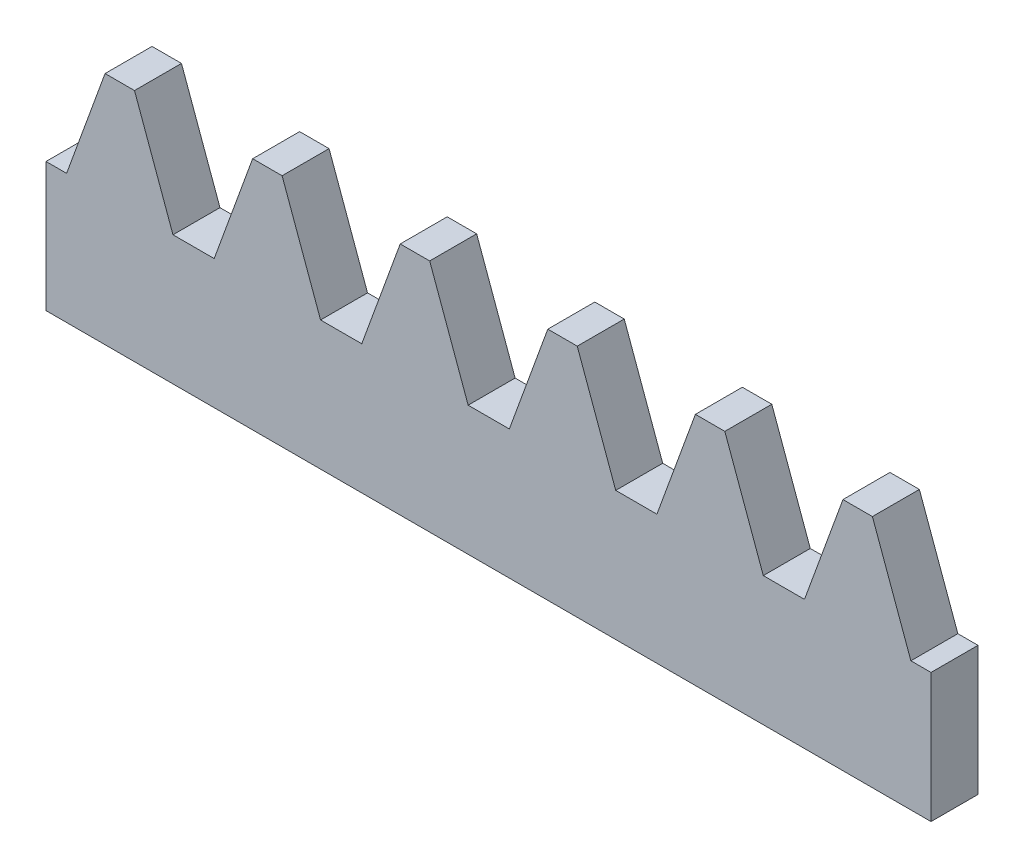
ISO-10303-21;
HEADER;
FILE_DESCRIPTION(('STEP AP214'),'2;1');
FILE_NAME('part.step','',(''),(''),'','','');
FILE_SCHEMA(('AUTOMOTIVE_DESIGN { 1 0 10303 214 1 1 1 1 }'));
ENDSEC;
DATA;
#1=APPLICATION_CONTEXT('core data for automotive mechanical design processes');
#2=APPLICATION_PROTOCOL_DEFINITION('international standard','automotive_design',2000,#1);
#3=PRODUCT_CONTEXT('',#1,'mechanical');
#4=PRODUCT('Part','Part','',(#3));
#5=PRODUCT_RELATED_PRODUCT_CATEGORY('part','',(#4));
#6=PRODUCT_DEFINITION_FORMATION('','',#4);
#7=PRODUCT_DEFINITION_CONTEXT('part definition',#1,'design');
#8=PRODUCT_DEFINITION('design','',#6,#7);
#9=PRODUCT_DEFINITION_SHAPE('','',#8);
#10=(LENGTH_UNIT() NAMED_UNIT(*) SI_UNIT(.MILLI.,.METRE.));
#11=(NAMED_UNIT(*) PLANE_ANGLE_UNIT() SI_UNIT($,.RADIAN.));
#12=(NAMED_UNIT(*) SI_UNIT($,.STERADIAN.) SOLID_ANGLE_UNIT());
#13=UNCERTAINTY_MEASURE_WITH_UNIT(LENGTH_MEASURE(1.E-05),#10,'distance_accuracy_value','');
#14=(GEOMETRIC_REPRESENTATION_CONTEXT(3) GLOBAL_UNCERTAINTY_ASSIGNED_CONTEXT((#13)) GLOBAL_UNIT_ASSIGNED_CONTEXT((#10,
#11,#12)) REPRESENTATION_CONTEXT('',''));
#15=CARTESIAN_POINT('',(0.,0.,0.));
#16=DIRECTION('',(0.,0.,1.));
#17=DIRECTION('',(1.,0.,0.));
#18=AXIS2_PLACEMENT_3D('',#15,#16,#17);
#19=CARTESIAN_POINT('',(0.,32.7476290034239,21.3342048450141));
#20=DIRECTION('',(0.,1.,0.));
#21=DIRECTION('',(0.,0.,1.));
#22=AXIS2_PLACEMENT_3D('',#19,#20,#21);
#23=PLANE('',#22);
#24=DIRECTION('',(0.,0.,1.));
#25=VECTOR('',#24,1.);
#26=CARTESIAN_POINT('',(91.7612773180347,32.7476290034239,21.3342048450141));
#27=LINE('',#26,#25);
#28=CARTESIAN_POINT('',(91.7612773180347,32.7476290034239,21.3342048450141));
#29=VERTEX_POINT('',#28);
#30=CARTESIAN_POINT('',(91.7612773180347,32.7476290034239,27.6842048450141));
#31=VERTEX_POINT('',#30);
#32=EDGE_CURVE('E266',#29,#31,#27,.T.);
#33=ORIENTED_EDGE('',*,*,#32,.F.);
#34=DIRECTION('',(-1.,0.,0.));
#35=VECTOR('',#34,1.);
#36=CARTESIAN_POINT('',(0.,32.7476290034239,21.3342048450141));
#37=LINE('',#36,#35);
#38=CARTESIAN_POINT('',(87.7807426294653,32.7476290034239,21.3342048450141));
#39=VERTEX_POINT('',#38);
#40=EDGE_CURVE('E393',#29,#39,#37,.T.);
#41=ORIENTED_EDGE('',*,*,#40,.T.);
#42=DIRECTION('',(0.,0.,-1.));
#43=VECTOR('',#42,1.);
#44=CARTESIAN_POINT('',(87.7807426294653,32.7476290034239,21.3342048450141));
#45=LINE('',#44,#43);
#46=CARTESIAN_POINT('',(87.7807426294653,32.7476290034239,27.6842048450141));
#47=VERTEX_POINT('',#46);
#48=EDGE_CURVE('E286',#47,#39,#45,.T.);
#49=ORIENTED_EDGE('',*,*,#48,.F.);
#50=DIRECTION('',(-1.,0.,0.));
#51=VECTOR('',#50,1.);
#52=CARTESIAN_POINT('',(0.,32.7476290034239,27.6842048450141));
#53=LINE('',#52,#51);
#54=EDGE_CURVE('E403',#31,#47,#53,.T.);
#55=ORIENTED_EDGE('',*,*,#54,.F.);
#56=EDGE_LOOP('',(#33,#41,#49,#55));
#57=FACE_BOUND('',#56,.T.);
#58=ADVANCED_FACE('F37',(#57),#23,.T.);
#59=DIRECTION('',(0.,0.,1.));
#60=VECTOR('',#59,1.);
#61=CARTESIAN_POINT('',(71.8121639905347,32.7476290034239,21.3342048450141));
#62=LINE('',#61,#60);
#63=CARTESIAN_POINT('',(71.8121639905347,32.7476290034239,21.3342048450141));
#64=VERTEX_POINT('',#63);
#65=CARTESIAN_POINT('',(71.8121639905347,32.7476290034239,27.6842048450141));
#66=VERTEX_POINT('',#65);
#67=EDGE_CURVE('E290',#64,#66,#62,.T.);
#68=ORIENTED_EDGE('',*,*,#67,.F.);
#69=CARTESIAN_POINT('',(67.8316293019653,32.7476290034239,21.3342048450141));
#70=VERTEX_POINT('',#69);
#71=EDGE_CURVE('E461',#64,#70,#37,.T.);
#72=ORIENTED_EDGE('',*,*,#71,.T.);
#73=DIRECTION('',(0.,0.,-1.));
#74=VECTOR('',#73,1.);
#75=CARTESIAN_POINT('',(67.8316293019653,32.7476290034239,21.3342048450141));
#76=LINE('',#75,#74);
#77=CARTESIAN_POINT('',(67.8316293019653,32.7476290034239,27.6842048450141));
#78=VERTEX_POINT('',#77);
#79=EDGE_CURVE('E310',#78,#70,#76,.T.);
#80=ORIENTED_EDGE('',*,*,#79,.F.);
#81=EDGE_CURVE('E434',#66,#78,#53,.T.);
#82=ORIENTED_EDGE('',*,*,#81,.F.);
#83=EDGE_LOOP('',(#68,#72,#80,#82));
#84=FACE_BOUND('',#83,.T.);
#85=ADVANCED_FACE('F479',(#84),#23,.T.);
#86=DIRECTION('',(0.,0.,1.));
#87=VECTOR('',#86,1.);
#88=CARTESIAN_POINT('',(51.8630506630347,32.7476290034239,21.3342048450141));
#89=LINE('',#88,#87);
#90=CARTESIAN_POINT('',(51.8630506630347,32.7476290034239,21.3342048450141));
#91=VERTEX_POINT('',#90);
#92=CARTESIAN_POINT('',(51.8630506630347,32.7476290034239,27.6842048450141));
#93=VERTEX_POINT('',#92);
#94=EDGE_CURVE('E314',#91,#93,#89,.T.);
#95=ORIENTED_EDGE('',*,*,#94,.F.);
#96=CARTESIAN_POINT('',(47.8825159744653,32.7476290034239,21.3342048450141));
#97=VERTEX_POINT('',#96);
#98=EDGE_CURVE('E456',#91,#97,#37,.T.);
#99=ORIENTED_EDGE('',*,*,#98,.T.);
#100=DIRECTION('',(0.,0.,-1.));
#101=VECTOR('',#100,1.);
#102=CARTESIAN_POINT('',(47.8825159744653,32.7476290034239,21.3342048450141));
#103=LINE('',#102,#101);
#104=CARTESIAN_POINT('',(47.8825159744653,32.7476290034239,27.6842048450141));
#105=VERTEX_POINT('',#104);
#106=EDGE_CURVE('E334',#105,#97,#103,.T.);
#107=ORIENTED_EDGE('',*,*,#106,.F.);
#108=EDGE_CURVE('E435',#93,#105,#53,.T.);
#109=ORIENTED_EDGE('',*,*,#108,.F.);
#110=EDGE_LOOP('',(#95,#99,#107,#109));
#111=FACE_BOUND('',#110,.T.);
#112=ADVANCED_FACE('F489',(#111),#23,.T.);
#113=DIRECTION('',(0.,0.,1.));
#114=VECTOR('',#113,1.);
#115=CARTESIAN_POINT('',(31.9139373355347,32.7476290034239,21.3342048450141));
#116=LINE('',#115,#114);
#117=CARTESIAN_POINT('',(31.9139373355347,32.7476290034239,21.3342048450141));
#118=VERTEX_POINT('',#117);
#119=CARTESIAN_POINT('',(31.9139373355347,32.7476290034239,27.6842048450141));
#120=VERTEX_POINT('',#119);
#121=EDGE_CURVE('E338',#118,#120,#116,.T.);
#122=ORIENTED_EDGE('',*,*,#121,.F.);
#123=CARTESIAN_POINT('',(27.9334026469653,32.7476290034239,21.3342048450141));
#124=VERTEX_POINT('',#123);
#125=EDGE_CURVE('E455',#118,#124,#37,.T.);
#126=ORIENTED_EDGE('',*,*,#125,.T.);
#127=DIRECTION('',(0.,0.,-1.));
#128=VECTOR('',#127,1.);
#129=CARTESIAN_POINT('',(27.9334026469653,32.7476290034239,21.3342048450141));
#130=LINE('',#129,#128);
#131=CARTESIAN_POINT('',(27.9334026469653,32.7476290034239,27.6842048450141));
#132=VERTEX_POINT('',#131);
#133=EDGE_CURVE('E358',#132,#124,#130,.T.);
#134=ORIENTED_EDGE('',*,*,#133,.F.);
#135=EDGE_CURVE('E438',#120,#132,#53,.T.);
#136=ORIENTED_EDGE('',*,*,#135,.F.);
#137=EDGE_LOOP('',(#122,#126,#134,#136));
#138=FACE_BOUND('',#137,.T.);
#139=ADVANCED_FACE('F499',(#138),#23,.T.);
#140=DIRECTION('',(0.,0.,1.));
#141=VECTOR('',#140,1.);
#142=CARTESIAN_POINT('',(11.9648240080347,32.7476290034239,21.3342048450141));
#143=LINE('',#142,#141);
#144=CARTESIAN_POINT('',(11.9648240080347,32.7476290034239,21.3342048450141));
#145=VERTEX_POINT('',#144);
#146=CARTESIAN_POINT('',(11.9648240080347,32.7476290034239,27.6842048450141));
#147=VERTEX_POINT('',#146);
#148=EDGE_CURVE('E362',#145,#147,#143,.T.);
#149=ORIENTED_EDGE('',*,*,#148,.F.);
#150=CARTESIAN_POINT('',(7.98428931946533,32.7476290034239,21.3342048450141));
#151=VERTEX_POINT('',#150);
#152=EDGE_CURVE('E390',#145,#151,#37,.T.);
#153=ORIENTED_EDGE('',*,*,#152,.T.);
#154=DIRECTION('',(0.,0.,-1.));
#155=VECTOR('',#154,1.);
#156=CARTESIAN_POINT('',(7.98428931946533,32.7476290034239,21.3342048450141));
#157=LINE('',#156,#155);
#158=CARTESIAN_POINT('',(7.98428931946533,32.7476290034239,27.6842048450141));
#159=VERTEX_POINT('',#158);
#160=EDGE_CURVE('E378',#159,#151,#157,.T.);
#161=ORIENTED_EDGE('',*,*,#160,.F.);
#162=EDGE_CURVE('E401',#147,#159,#53,.T.);
#163=ORIENTED_EDGE('',*,*,#162,.F.);
#164=EDGE_LOOP('',(#149,#153,#161,#163));
#165=FACE_BOUND('',#164,.T.);
#166=ADVANCED_FACE('F453',(#165),#23,.T.);
#167=CARTESIAN_POINT('',(0.,0.997629003423928,21.3342048450141));
#168=DIRECTION('',(-1.,0.,0.));
#169=DIRECTION('',(0.,0.,1.));
#170=AXIS2_PLACEMENT_3D('',#167,#168,#169);
#171=PLANE('',#170);
#172=DIRECTION('',(0.,0.,1.));
#173=VECTOR('',#172,1.);
#174=CARTESIAN_POINT('',(0.,18.4601290034239,21.3342048450141));
#175=LINE('',#174,#173);
#176=CARTESIAN_POINT('',(0.,18.4601290034239,21.3342048450141));
#177=VERTEX_POINT('',#176);
#178=CARTESIAN_POINT('',(0.,18.4601290034239,27.6842048450141));
#179=VERTEX_POINT('',#178);
#180=EDGE_CURVE('E376',#177,#179,#175,.T.);
#181=ORIENTED_EDGE('',*,*,#180,.F.);
#182=DIRECTION('',(0.,-1.,0.));
#183=VECTOR('',#182,1.);
#184=CARTESIAN_POINT('',(0.,0.997629003423928,21.3342048450141));
#185=LINE('',#184,#183);
#186=CARTESIAN_POINT('',(0.,0.997629003423928,21.3342048450141));
#187=VERTEX_POINT('',#186);
#188=EDGE_CURVE('E382',#177,#187,#185,.T.);
#189=ORIENTED_EDGE('',*,*,#188,.T.);
#190=DIRECTION('',(0.,0.,1.));
#191=VECTOR('',#190,1.);
#192=CARTESIAN_POINT('',(0.,0.997629003423928,21.3342048450141));
#193=LINE('',#192,#191);
#194=CARTESIAN_POINT('',(0.,0.997629003423928,27.6842048450141));
#195=VERTEX_POINT('',#194);
#196=EDGE_CURVE('E392',#187,#195,#193,.T.);
#197=ORIENTED_EDGE('',*,*,#196,.T.);
#198=DIRECTION('',(0.,-1.,0.));
#199=VECTOR('',#198,1.);
#200=CARTESIAN_POINT('',(0.,0.997629003423928,27.6842048450141));
#201=LINE('',#200,#199);
#202=EDGE_CURVE('E381',#179,#195,#201,.T.);
#203=ORIENTED_EDGE('',*,*,#202,.F.);
#204=EDGE_LOOP('',(#181,#189,#197,#203));
#205=FACE_BOUND('',#204,.T.);
#206=ADVANCED_FACE('F39',(#205),#171,.T.);
#207=DIRECTION('',(0.,0.,1.));
#208=VECTOR('',#207,1.);
#209=CARTESIAN_POINT('',(111.710390645535,32.7476290034239,21.3342048450141));
#210=LINE('',#209,#208);
#211=CARTESIAN_POINT('',(111.710390645535,32.7476290034239,21.3342048450141));
#212=VERTEX_POINT('',#211);
#213=CARTESIAN_POINT('',(111.710390645535,32.7476290034239,27.6842048450141));
#214=VERTEX_POINT('',#213);
#215=EDGE_CURVE('E245',#212,#214,#210,.T.);
#216=ORIENTED_EDGE('',*,*,#215,.F.);
#217=CARTESIAN_POINT('',(107.729855956965,32.7476290034239,21.3342048450141));
#218=VERTEX_POINT('',#217);
#219=EDGE_CURVE('E239',#212,#218,#37,.T.);
#220=ORIENTED_EDGE('',*,*,#219,.T.);
#221=DIRECTION('',(0.,0.,-1.));
#222=VECTOR('',#221,1.);
#223=CARTESIAN_POINT('',(107.729855956965,32.7476290034239,21.3342048450141));
#224=LINE('',#223,#222);
#225=CARTESIAN_POINT('',(107.729855956965,32.7476290034239,27.6842048450141));
#226=VERTEX_POINT('',#225);
#227=EDGE_CURVE('E262',#226,#218,#224,.T.);
#228=ORIENTED_EDGE('',*,*,#227,.F.);
#229=EDGE_CURVE('E385',#214,#226,#53,.T.);
#230=ORIENTED_EDGE('',*,*,#229,.F.);
#231=EDGE_LOOP('',(#216,#220,#228,#230));
#232=FACE_BOUND('',#231,.T.);
#233=ADVANCED_FACE('F522',(#232),#23,.T.);
#234=CARTESIAN_POINT('',(119.634,0.997629003423928,21.3342048450141));
#235=DIRECTION('',(1.,0.,0.));
#236=DIRECTION('',(0.,0.,-1.));
#237=AXIS2_PLACEMENT_3D('',#234,#235,#236);
#238=PLANE('',#237);
#239=DIRECTION('',(0.,0.,-1.));
#240=VECTOR('',#239,1.);
#241=CARTESIAN_POINT('',(119.634,18.4601290034239,21.3342048450141));
#242=LINE('',#241,#240);
#243=CARTESIAN_POINT('',(119.634,18.4601290034239,27.6842048450141));
#244=VERTEX_POINT('',#243);
#245=CARTESIAN_POINT('',(119.634,18.4601290034239,21.3342048450141));
#246=VERTEX_POINT('',#245);
#247=EDGE_CURVE('E226',#244,#246,#242,.T.);
#248=ORIENTED_EDGE('',*,*,#247,.F.);
#249=DIRECTION('',(0.,1.,0.));
#250=VECTOR('',#249,1.);
#251=CARTESIAN_POINT('',(119.634,0.997629003423928,27.6842048450141));
#252=LINE('',#251,#250);
#253=CARTESIAN_POINT('',(119.634,0.997629003423928,27.6842048450141));
#254=VERTEX_POINT('',#253);
#255=EDGE_CURVE('E398',#254,#244,#252,.T.);
#256=ORIENTED_EDGE('',*,*,#255,.F.);
#257=DIRECTION('',(0.,0.,1.));
#258=VECTOR('',#257,1.);
#259=CARTESIAN_POINT('',(119.634,0.997629003423928,21.3342048450141));
#260=LINE('',#259,#258);
#261=CARTESIAN_POINT('',(119.634,0.997629003423928,21.3342048450141));
#262=VERTEX_POINT('',#261);
#263=EDGE_CURVE('E404',#262,#254,#260,.T.);
#264=ORIENTED_EDGE('',*,*,#263,.F.);
#265=DIRECTION('',(0.,1.,0.));
#266=VECTOR('',#265,1.);
#267=CARTESIAN_POINT('',(119.634,0.997629003423928,21.3342048450141));
#268=LINE('',#267,#266);
#269=EDGE_CURVE('E388',#262,#246,#268,.T.);
#270=ORIENTED_EDGE('',*,*,#269,.T.);
#271=EDGE_LOOP('',(#248,#256,#264,#270));
#272=FACE_BOUND('',#271,.T.);
#273=ADVANCED_FACE('F529',(#272),#238,.T.);
#274=CARTESIAN_POINT('',(0.,0.997629003423928,21.3342048450141));
#275=DIRECTION('',(0.,-1.,0.));
#276=DIRECTION('',(0.,0.,-1.));
#277=AXIS2_PLACEMENT_3D('',#274,#275,#276);
#278=PLANE('',#277);
#279=DIRECTION('',(1.,0.,0.));
#280=VECTOR('',#279,1.);
#281=CARTESIAN_POINT('',(0.,0.997629003423928,27.6842048450141));
#282=LINE('',#281,#280);
#283=EDGE_CURVE('E395',#195,#254,#282,.T.);
#284=ORIENTED_EDGE('',*,*,#283,.F.);
#285=ORIENTED_EDGE('',*,*,#196,.F.);
#286=DIRECTION('',(1.,0.,0.));
#287=VECTOR('',#286,1.);
#288=CARTESIAN_POINT('',(0.,0.997629003423928,21.3342048450141));
#289=LINE('',#288,#287);
#290=EDGE_CURVE('E384',#187,#262,#289,.T.);
#291=ORIENTED_EDGE('',*,*,#290,.T.);
#292=ORIENTED_EDGE('',*,*,#263,.T.);
#293=EDGE_LOOP('',(#284,#285,#291,#292));
#294=FACE_BOUND('',#293,.T.);
#295=ADVANCED_FACE('F535',(#294),#278,.T.);
#296=CARTESIAN_POINT('',(0.,32.7476290034239,21.3342048450141));
#297=DIRECTION('',(0.,0.,-1.));
#298=DIRECTION('',(-1.,0.,0.));
#299=AXIS2_PLACEMENT_3D('',#296,#297,#298);
#300=PLANE('',#299);
#301=DIRECTION('',(0.342020143325663,-0.939692620785911,0.));
#302=VECTOR('',#301,1.);
#303=CARTESIAN_POINT('',(111.701145801584,32.7730290034239,21.3342048450141));
#304=LINE('',#303,#302);
#305=CARTESIAN_POINT('',(116.910615367613,18.4601290034239,21.3342048450141));
#306=VERTEX_POINT('',#305);
#307=EDGE_CURVE('E223',#212,#306,#304,.T.);
#308=ORIENTED_EDGE('',*,*,#307,.T.);
#309=DIRECTION('',(1.,0.,0.));
#310=VECTOR('',#309,1.);
#311=CARTESIAN_POINT('',(122.478744562387,18.4601290034239,21.3342048450141));
#312=LINE('',#311,#310);
#313=EDGE_CURVE('E227',#306,#246,#312,.T.);
#314=ORIENTED_EDGE('',*,*,#313,.T.);
#315=ORIENTED_EDGE('',*,*,#269,.F.);
#316=ORIENTED_EDGE('',*,*,#290,.F.);
#317=ORIENTED_EDGE('',*,*,#188,.F.);
#318=DIRECTION('',(1.,0.,0.));
#319=VECTOR('',#318,1.);
#320=CARTESIAN_POINT('',(2.78406459738706,18.4601290034239,21.3342048450141));
#321=LINE('',#320,#319);
#322=CARTESIAN_POINT('',(2.78406459738706,18.4601290034239,21.3342048450141));
#323=VERTEX_POINT('',#322);
#324=EDGE_CURVE('E365',#177,#323,#321,.T.);
#325=ORIENTED_EDGE('',*,*,#324,.T.);
#326=DIRECTION('',(0.342020143325663,0.939692620785911,0.));
#327=VECTOR('',#326,1.);
#328=CARTESIAN_POINT('',(7.99353416341569,32.7730290034239,21.3342048450141));
#329=LINE('',#328,#327);
#330=EDGE_CURVE('E368',#323,#151,#329,.T.);
#331=ORIENTED_EDGE('',*,*,#330,.T.);
#332=ORIENTED_EDGE('',*,*,#152,.F.);
#333=DIRECTION('',(0.342020143325663,-0.939692620785911,0.));
#334=VECTOR('',#333,1.);
#335=CARTESIAN_POINT('',(11.9555791640843,32.7730290034239,21.3342048450141));
#336=LINE('',#335,#334);
#337=CARTESIAN_POINT('',(17.1650487301129,18.4601290034239,21.3342048450141));
#338=VERTEX_POINT('',#337);
#339=EDGE_CURVE('E341',#145,#338,#336,.T.);
#340=ORIENTED_EDGE('',*,*,#339,.T.);
#341=DIRECTION('',(1.,0.,0.));
#342=VECTOR('',#341,1.);
#343=CARTESIAN_POINT('',(22.7331779248871,18.4601290034239,21.3342048450141));
#344=LINE('',#343,#342);
#345=CARTESIAN_POINT('',(22.7331779248871,18.4601290034239,21.3342048450141));
#346=VERTEX_POINT('',#345);
#347=EDGE_CURVE('E344',#338,#346,#344,.T.);
#348=ORIENTED_EDGE('',*,*,#347,.T.);
#349=DIRECTION('',(0.342020143325663,0.939692620785911,0.));
#350=VECTOR('',#349,1.);
#351=CARTESIAN_POINT('',(27.9426474909157,32.7730290034239,21.3342048450141));
#352=LINE('',#351,#350);
#353=EDGE_CURVE('E348',#346,#124,#352,.T.);
#354=ORIENTED_EDGE('',*,*,#353,.T.);
#355=ORIENTED_EDGE('',*,*,#125,.F.);
#356=DIRECTION('',(0.342020143325663,-0.939692620785911,0.));
#357=VECTOR('',#356,1.);
#358=CARTESIAN_POINT('',(31.9046924915843,32.7730290034239,21.3342048450141));
#359=LINE('',#358,#357);
#360=CARTESIAN_POINT('',(37.1141620576129,18.4601290034239,21.3342048450141));
#361=VERTEX_POINT('',#360);
#362=EDGE_CURVE('E317',#118,#361,#359,.T.);
#363=ORIENTED_EDGE('',*,*,#362,.T.);
#364=DIRECTION('',(1.,0.,0.));
#365=VECTOR('',#364,1.);
#366=CARTESIAN_POINT('',(42.6822912523871,18.4601290034239,21.3342048450141));
#367=LINE('',#366,#365);
#368=CARTESIAN_POINT('',(42.6822912523871,18.4601290034239,21.3342048450141));
#369=VERTEX_POINT('',#368);
#370=EDGE_CURVE('E320',#361,#369,#367,.T.);
#371=ORIENTED_EDGE('',*,*,#370,.T.);
#372=DIRECTION('',(0.342020143325663,0.939692620785911,0.));
#373=VECTOR('',#372,1.);
#374=CARTESIAN_POINT('',(47.8917608184157,32.7730290034239,21.3342048450141));
#375=LINE('',#374,#373);
#376=EDGE_CURVE('E324',#369,#97,#375,.T.);
#377=ORIENTED_EDGE('',*,*,#376,.T.);
#378=ORIENTED_EDGE('',*,*,#98,.F.);
#379=DIRECTION('',(0.342020143325663,-0.939692620785911,0.));
#380=VECTOR('',#379,1.);
#381=CARTESIAN_POINT('',(51.8538058190843,32.7730290034239,21.3342048450141));
#382=LINE('',#381,#380);
#383=CARTESIAN_POINT('',(57.0632753851129,18.4601290034239,21.3342048450141));
#384=VERTEX_POINT('',#383);
#385=EDGE_CURVE('E293',#91,#384,#382,.T.);
#386=ORIENTED_EDGE('',*,*,#385,.T.);
#387=DIRECTION('',(1.,0.,0.));
#388=VECTOR('',#387,1.);
#389=CARTESIAN_POINT('',(62.6314045798871,18.4601290034239,21.3342048450141));
#390=LINE('',#389,#388);
#391=CARTESIAN_POINT('',(62.6314045798871,18.4601290034239,21.3342048450141));
#392=VERTEX_POINT('',#391);
#393=EDGE_CURVE('E296',#384,#392,#390,.T.);
#394=ORIENTED_EDGE('',*,*,#393,.T.);
#395=DIRECTION('',(0.342020143325663,0.939692620785911,0.));
#396=VECTOR('',#395,1.);
#397=CARTESIAN_POINT('',(67.8408741459157,32.7730290034239,21.3342048450141));
#398=LINE('',#397,#396);
#399=EDGE_CURVE('E300',#392,#70,#398,.T.);
#400=ORIENTED_EDGE('',*,*,#399,.T.);
#401=ORIENTED_EDGE('',*,*,#71,.F.);
#402=DIRECTION('',(0.342020143325663,-0.939692620785911,0.));
#403=VECTOR('',#402,1.);
#404=CARTESIAN_POINT('',(71.8029191465843,32.7730290034239,21.3342048450141));
#405=LINE('',#404,#403);
#406=CARTESIAN_POINT('',(77.0123887126129,18.4601290034239,21.3342048450141));
#407=VERTEX_POINT('',#406);
#408=EDGE_CURVE('E269',#64,#407,#405,.T.);
#409=ORIENTED_EDGE('',*,*,#408,.T.);
#410=DIRECTION('',(1.,0.,0.));
#411=VECTOR('',#410,1.);
#412=CARTESIAN_POINT('',(82.5805179073871,18.4601290034239,21.3342048450141));
#413=LINE('',#412,#411);
#414=CARTESIAN_POINT('',(82.5805179073871,18.4601290034239,21.3342048450141));
#415=VERTEX_POINT('',#414);
#416=EDGE_CURVE('E272',#407,#415,#413,.T.);
#417=ORIENTED_EDGE('',*,*,#416,.T.);
#418=DIRECTION('',(0.342020143325663,0.939692620785911,0.));
#419=VECTOR('',#418,1.);
#420=CARTESIAN_POINT('',(87.7899874734157,32.7730290034239,21.3342048450141));
#421=LINE('',#420,#419);
#422=EDGE_CURVE('E276',#415,#39,#421,.T.);
#423=ORIENTED_EDGE('',*,*,#422,.T.);
#424=ORIENTED_EDGE('',*,*,#40,.F.);
#425=DIRECTION('',(0.342020143325663,-0.939692620785911,0.));
#426=VECTOR('',#425,1.);
#427=CARTESIAN_POINT('',(91.7520324740843,32.7730290034239,21.3342048450141));
#428=LINE('',#427,#426);
#429=CARTESIAN_POINT('',(96.9615020401129,18.4601290034239,21.3342048450141));
#430=VERTEX_POINT('',#429);
#431=EDGE_CURVE('E248',#29,#430,#428,.T.);
#432=ORIENTED_EDGE('',*,*,#431,.T.);
#433=DIRECTION('',(1.,0.,0.));
#434=VECTOR('',#433,1.);
#435=CARTESIAN_POINT('',(102.529631234887,18.4601290034239,21.3342048450141));
#436=LINE('',#435,#434);
#437=CARTESIAN_POINT('',(102.529631234887,18.4601290034239,21.3342048450141));
#438=VERTEX_POINT('',#437);
#439=EDGE_CURVE('E251',#430,#438,#436,.T.);
#440=ORIENTED_EDGE('',*,*,#439,.T.);
#441=DIRECTION('',(0.342020143325663,0.939692620785911,0.));
#442=VECTOR('',#441,1.);
#443=CARTESIAN_POINT('',(107.739100800916,32.7730290034239,21.3342048450141));
#444=LINE('',#443,#442);
#445=EDGE_CURVE('E255',#438,#218,#444,.T.);
#446=ORIENTED_EDGE('',*,*,#445,.T.);
#447=ORIENTED_EDGE('',*,*,#219,.F.);
#448=EDGE_LOOP('',(#308,#314,#315,#316,#317,#325,#331,#332,#340,#348,#354,#355,#363,#371,#377,
#378,#386,#394,#400,#401,#409,#417,#423,#424,#432,#440,#446,#447));
#449=FACE_BOUND('',#448,.T.);
#450=ADVANCED_FACE('F237',(#449),#300,.T.);
#451=CARTESIAN_POINT('',(0.,32.7476290034239,27.6842048450141));
#452=DIRECTION('',(0.,0.,-1.));
#453=DIRECTION('',(-1.,0.,0.));
#454=AXIS2_PLACEMENT_3D('',#451,#452,#453);
#455=PLANE('',#454);
#456=DIRECTION('',(1.,0.,0.));
#457=VECTOR('',#456,1.);
#458=CARTESIAN_POINT('',(122.478744562387,18.4601290034239,27.6842048450141));
#459=LINE('',#458,#457);
#460=CARTESIAN_POINT('',(116.910615367613,18.4601290034239,27.6842048450141));
#461=VERTEX_POINT('',#460);
#462=EDGE_CURVE('E240',#461,#244,#459,.T.);
#463=ORIENTED_EDGE('',*,*,#462,.F.);
#464=DIRECTION('',(-0.342020143325663,0.939692620785911,0.));
#465=VECTOR('',#464,1.);
#466=CARTESIAN_POINT('',(98.6427573190988,68.6506564935198,27.6842048450141));
#467=LINE('',#466,#465);
#468=EDGE_CURVE('E11',#461,#214,#467,.T.);
#469=ORIENTED_EDGE('',*,*,#468,.T.);
#470=ORIENTED_EDGE('',*,*,#229,.T.);
#471=DIRECTION('',(0.342020143325663,0.939692620785911,0.));
#472=VECTOR('',#471,1.);
#473=CARTESIAN_POINT('',(107.739100800916,32.7730290034239,27.6842048450141));
#474=LINE('',#473,#472);
#475=CARTESIAN_POINT('',(102.529631234887,18.4601290034239,27.6842048450141));
#476=VERTEX_POINT('',#475);
#477=EDGE_CURVE('E252',#476,#226,#474,.T.);
#478=ORIENTED_EDGE('',*,*,#477,.F.);
#479=DIRECTION('',(1.,0.,0.));
#480=VECTOR('',#479,1.);
#481=CARTESIAN_POINT('',(102.529631234887,18.4601290034239,27.6842048450141));
#482=LINE('',#481,#480);
#483=CARTESIAN_POINT('',(96.9615020401129,18.4601290034239,27.6842048450141));
#484=VERTEX_POINT('',#483);
#485=EDGE_CURVE('E247',#484,#476,#482,.T.);
#486=ORIENTED_EDGE('',*,*,#485,.F.);
#487=DIRECTION('',(-0.342020143325663,0.939692620785911,0.));
#488=VECTOR('',#487,1.);
#489=CARTESIAN_POINT('',(81.0272469505077,62.2391350579451,27.6842048450141));
#490=LINE('',#489,#488);
#491=EDGE_CURVE('E45',#484,#31,#490,.T.);
#492=ORIENTED_EDGE('',*,*,#491,.T.);
#493=ORIENTED_EDGE('',*,*,#54,.T.);
#494=DIRECTION('',(0.342020143325663,0.939692620785911,0.));
#495=VECTOR('',#494,1.);
#496=CARTESIAN_POINT('',(87.7899874734157,32.7730290034239,27.6842048450141));
#497=LINE('',#496,#495);
#498=CARTESIAN_POINT('',(82.5805179073871,18.4601290034239,27.6842048450141));
#499=VERTEX_POINT('',#498);
#500=EDGE_CURVE('E273',#499,#47,#497,.T.);
#501=ORIENTED_EDGE('',*,*,#500,.F.);
#502=DIRECTION('',(1.,0.,0.));
#503=VECTOR('',#502,1.);
#504=CARTESIAN_POINT('',(82.5805179073871,18.4601290034239,27.6842048450141));
#505=LINE('',#504,#503);
#506=CARTESIAN_POINT('',(77.0123887126129,18.4601290034239,27.6842048450141));
#507=VERTEX_POINT('',#506);
#508=EDGE_CURVE('E268',#507,#499,#505,.T.);
#509=ORIENTED_EDGE('',*,*,#508,.F.);
#510=DIRECTION('',(-0.342020143325663,0.939692620785911,0.));
#511=VECTOR('',#510,1.);
#512=CARTESIAN_POINT('',(63.4117365819165,55.8276136223704,27.6842048450141));
#513=LINE('',#512,#511);
#514=EDGE_CURVE('E420',#507,#66,#513,.T.);
#515=ORIENTED_EDGE('',*,*,#514,.T.);
#516=ORIENTED_EDGE('',*,*,#81,.T.);
#517=DIRECTION('',(0.342020143325663,0.939692620785911,0.));
#518=VECTOR('',#517,1.);
#519=CARTESIAN_POINT('',(67.8408741459157,32.7730290034239,27.6842048450141));
#520=LINE('',#519,#518);
#521=CARTESIAN_POINT('',(62.6314045798871,18.4601290034239,27.6842048450141));
#522=VERTEX_POINT('',#521);
#523=EDGE_CURVE('E297',#522,#78,#520,.T.);
#524=ORIENTED_EDGE('',*,*,#523,.F.);
#525=DIRECTION('',(1.,0.,0.));
#526=VECTOR('',#525,1.);
#527=CARTESIAN_POINT('',(62.6314045798871,18.4601290034239,27.6842048450141));
#528=LINE('',#527,#526);
#529=CARTESIAN_POINT('',(57.0632753851129,18.4601290034239,27.6842048450141));
#530=VERTEX_POINT('',#529);
#531=EDGE_CURVE('E292',#530,#522,#528,.T.);
#532=ORIENTED_EDGE('',*,*,#531,.F.);
#533=DIRECTION('',(-0.342020143325663,0.939692620785911,0.));
#534=VECTOR('',#533,1.);
#535=CARTESIAN_POINT('',(45.7962262133254,49.4160921867957,27.6842048450141));
#536=LINE('',#535,#534);
#537=EDGE_CURVE('E417',#530,#93,#536,.T.);
#538=ORIENTED_EDGE('',*,*,#537,.T.);
#539=ORIENTED_EDGE('',*,*,#108,.T.);
#540=DIRECTION('',(0.342020143325663,0.939692620785911,0.));
#541=VECTOR('',#540,1.);
#542=CARTESIAN_POINT('',(47.8917608184157,32.7730290034239,27.6842048450141));
#543=LINE('',#542,#541);
#544=CARTESIAN_POINT('',(42.6822912523871,18.4601290034239,27.6842048450141));
#545=VERTEX_POINT('',#544);
#546=EDGE_CURVE('E321',#545,#105,#543,.T.);
#547=ORIENTED_EDGE('',*,*,#546,.F.);
#548=DIRECTION('',(1.,0.,0.));
#549=VECTOR('',#548,1.);
#550=CARTESIAN_POINT('',(42.6822912523871,18.4601290034239,27.6842048450141));
#551=LINE('',#550,#549);
#552=CARTESIAN_POINT('',(37.1141620576129,18.4601290034239,27.6842048450141));
#553=VERTEX_POINT('',#552);
#554=EDGE_CURVE('E316',#553,#545,#551,.T.);
#555=ORIENTED_EDGE('',*,*,#554,.F.);
#556=DIRECTION('',(-0.342020143325663,0.939692620785911,0.));
#557=VECTOR('',#556,1.);
#558=CARTESIAN_POINT('',(28.1807158447343,43.0045707512209,27.6842048450141));
#559=LINE('',#558,#557);
#560=EDGE_CURVE('E414',#553,#120,#559,.T.);
#561=ORIENTED_EDGE('',*,*,#560,.T.);
#562=ORIENTED_EDGE('',*,*,#135,.T.);
#563=DIRECTION('',(0.342020143325663,0.939692620785911,0.));
#564=VECTOR('',#563,1.);
#565=CARTESIAN_POINT('',(27.9426474909157,32.7730290034239,27.6842048450141));
#566=LINE('',#565,#564);
#567=CARTESIAN_POINT('',(22.7331779248871,18.4601290034239,27.6842048450141));
#568=VERTEX_POINT('',#567);
#569=EDGE_CURVE('E345',#568,#132,#566,.T.);
#570=ORIENTED_EDGE('',*,*,#569,.F.);
#571=DIRECTION('',(1.,0.,0.));
#572=VECTOR('',#571,1.);
#573=CARTESIAN_POINT('',(22.7331779248871,18.4601290034239,27.6842048450141));
#574=LINE('',#573,#572);
#575=CARTESIAN_POINT('',(17.1650487301129,18.4601290034239,27.6842048450141));
#576=VERTEX_POINT('',#575);
#577=EDGE_CURVE('E340',#576,#568,#574,.T.);
#578=ORIENTED_EDGE('',*,*,#577,.F.);
#579=DIRECTION('',(-0.342020143325663,0.939692620785911,0.));
#580=VECTOR('',#579,1.);
#581=CARTESIAN_POINT('',(10.5652054761431,36.5930493156462,27.6842048450141));
#582=LINE('',#581,#580);
#583=EDGE_CURVE('E411',#576,#147,#582,.T.);
#584=ORIENTED_EDGE('',*,*,#583,.T.);
#585=ORIENTED_EDGE('',*,*,#162,.T.);
#586=DIRECTION('',(0.342020143325663,0.939692620785911,0.));
#587=VECTOR('',#586,1.);
#588=CARTESIAN_POINT('',(7.99353416341569,32.7730290034239,27.6842048450141));
#589=LINE('',#588,#587);
#590=CARTESIAN_POINT('',(2.78406459738706,18.4601290034239,27.6842048450141));
#591=VERTEX_POINT('',#590);
#592=EDGE_CURVE('E364',#591,#159,#589,.T.);
#593=ORIENTED_EDGE('',*,*,#592,.F.);
#594=DIRECTION('',(-1.,0.,0.));
#595=VECTOR('',#594,1.);
#596=CARTESIAN_POINT('',(0.,18.4601290034239,27.6842048450141));
#597=LINE('',#596,#595);
#598=EDGE_CURVE('E406',#591,#179,#597,.T.);
#599=ORIENTED_EDGE('',*,*,#598,.T.);
#600=ORIENTED_EDGE('',*,*,#202,.T.);
#601=ORIENTED_EDGE('',*,*,#283,.T.);
#602=ORIENTED_EDGE('',*,*,#255,.T.);
#603=EDGE_LOOP('',(#463,#469,#470,#478,#486,#492,#493,#501,#509,#515,#516,#524,#532,#538,#539,
#547,#555,#561,#562,#570,#578,#584,#585,#593,#599,#600,#601,#602));
#604=FACE_BOUND('',#603,.T.);
#605=ADVANCED_FACE('F426',(#604),#455,.F.);
#606=CARTESIAN_POINT('',(7.99353416341569,32.7730290034239,21.3342048450141));
#607=DIRECTION('',(0.93969262078591,-0.342020143325663,0.));
#608=DIRECTION('',(0.342020143325663,0.939692620785911,0.));
#609=AXIS2_PLACEMENT_3D('',#606,#607,#608);
#610=PLANE('',#609);
#611=ORIENTED_EDGE('',*,*,#160,.T.);
#612=ORIENTED_EDGE('',*,*,#330,.F.);
#613=DIRECTION('',(0.,0.,1.));
#614=VECTOR('',#613,1.);
#615=CARTESIAN_POINT('',(2.78406459738706,18.4601290034239,21.3342048450141));
#616=LINE('',#615,#614);
#617=EDGE_CURVE('E371',#323,#591,#616,.T.);
#618=ORIENTED_EDGE('',*,*,#617,.T.);
#619=ORIENTED_EDGE('',*,*,#592,.T.);
#620=EDGE_LOOP('',(#611,#612,#618,#619));
#621=FACE_BOUND('',#620,.T.);
#622=ADVANCED_FACE('F451',(#621),#610,.F.);
#623=CARTESIAN_POINT('',(2.78406459738706,18.4601290034239,21.3342048450141));
#624=DIRECTION('',(0.,-1.,0.));
#625=DIRECTION('',(0.,0.,-1.));
#626=AXIS2_PLACEMENT_3D('',#623,#624,#625);
#627=PLANE('',#626);
#628=ORIENTED_EDGE('',*,*,#180,.T.);
#629=ORIENTED_EDGE('',*,*,#598,.F.);
#630=ORIENTED_EDGE('',*,*,#617,.F.);
#631=ORIENTED_EDGE('',*,*,#324,.F.);
#632=EDGE_LOOP('',(#628,#629,#630,#631));
#633=FACE_BOUND('',#632,.T.);
#634=ADVANCED_FACE('F509',(#633),#627,.F.);
#635=CARTESIAN_POINT('',(11.9555791640843,32.7730290034239,21.3342048450141));
#636=DIRECTION('',(-0.93969262078591,-0.342020143325663,0.));
#637=DIRECTION('',(0.342020143325663,-0.939692620785911,0.));
#638=AXIS2_PLACEMENT_3D('',#635,#636,#637);
#639=PLANE('',#638);
#640=ORIENTED_EDGE('',*,*,#148,.T.);
#641=ORIENTED_EDGE('',*,*,#583,.F.);
#642=DIRECTION('',(0.,0.,1.));
#643=VECTOR('',#642,1.);
#644=CARTESIAN_POINT('',(17.1650487301129,18.4601290034239,21.3342048450141));
#645=LINE('',#644,#643);
#646=EDGE_CURVE('E351',#338,#576,#645,.T.);
#647=ORIENTED_EDGE('',*,*,#646,.F.);
#648=ORIENTED_EDGE('',*,*,#339,.F.);
#649=EDGE_LOOP('',(#640,#641,#647,#648));
#650=FACE_BOUND('',#649,.T.);
#651=ADVANCED_FACE('F507',(#650),#639,.F.);
#652=CARTESIAN_POINT('',(27.9426474909157,32.7730290034239,21.3342048450141));
#653=DIRECTION('',(0.93969262078591,-0.342020143325663,0.));
#654=DIRECTION('',(0.342020143325663,0.939692620785911,0.));
#655=AXIS2_PLACEMENT_3D('',#652,#653,#654);
#656=PLANE('',#655);
#657=ORIENTED_EDGE('',*,*,#133,.T.);
#658=ORIENTED_EDGE('',*,*,#353,.F.);
#659=DIRECTION('',(0.,0.,1.));
#660=VECTOR('',#659,1.);
#661=CARTESIAN_POINT('',(22.7331779248871,18.4601290034239,21.3342048450141));
#662=LINE('',#661,#660);
#663=EDGE_CURVE('E356',#346,#568,#662,.T.);
#664=ORIENTED_EDGE('',*,*,#663,.T.);
#665=ORIENTED_EDGE('',*,*,#569,.T.);
#666=EDGE_LOOP('',(#657,#658,#664,#665));
#667=FACE_BOUND('',#666,.T.);
#668=ADVANCED_FACE('F502',(#667),#656,.F.);
#669=CARTESIAN_POINT('',(22.7331779248871,18.4601290034239,21.3342048450141));
#670=DIRECTION('',(0.,-1.,0.));
#671=DIRECTION('',(0.,0.,-1.));
#672=AXIS2_PLACEMENT_3D('',#669,#670,#671);
#673=PLANE('',#672);
#674=ORIENTED_EDGE('',*,*,#577,.T.);
#675=ORIENTED_EDGE('',*,*,#663,.F.);
#676=ORIENTED_EDGE('',*,*,#347,.F.);
#677=ORIENTED_EDGE('',*,*,#646,.T.);
#678=EDGE_LOOP('',(#674,#675,#676,#677));
#679=FACE_BOUND('',#678,.T.);
#680=ADVANCED_FACE('F505',(#679),#673,.F.);
#681=CARTESIAN_POINT('',(31.9046924915843,32.7730290034239,21.3342048450141));
#682=DIRECTION('',(-0.93969262078591,-0.342020143325663,0.));
#683=DIRECTION('',(0.342020143325663,-0.939692620785911,0.));
#684=AXIS2_PLACEMENT_3D('',#681,#682,#683);
#685=PLANE('',#684);
#686=ORIENTED_EDGE('',*,*,#121,.T.);
#687=ORIENTED_EDGE('',*,*,#560,.F.);
#688=DIRECTION('',(0.,0.,1.));
#689=VECTOR('',#688,1.);
#690=CARTESIAN_POINT('',(37.1141620576129,18.4601290034239,21.3342048450141));
#691=LINE('',#690,#689);
#692=EDGE_CURVE('E327',#361,#553,#691,.T.);
#693=ORIENTED_EDGE('',*,*,#692,.F.);
#694=ORIENTED_EDGE('',*,*,#362,.F.);
#695=EDGE_LOOP('',(#686,#687,#693,#694));
#696=FACE_BOUND('',#695,.T.);
#697=ADVANCED_FACE('F629',(#696),#685,.F.);
#698=CARTESIAN_POINT('',(47.8917608184157,32.7730290034239,21.3342048450141));
#699=DIRECTION('',(0.93969262078591,-0.342020143325663,0.));
#700=DIRECTION('',(0.342020143325663,0.939692620785911,0.));
#701=AXIS2_PLACEMENT_3D('',#698,#699,#700);
#702=PLANE('',#701);
#703=ORIENTED_EDGE('',*,*,#106,.T.);
#704=ORIENTED_EDGE('',*,*,#376,.F.);
#705=DIRECTION('',(0.,0.,1.));
#706=VECTOR('',#705,1.);
#707=CARTESIAN_POINT('',(42.6822912523871,18.4601290034239,21.3342048450141));
#708=LINE('',#707,#706);
#709=EDGE_CURVE('E332',#369,#545,#708,.T.);
#710=ORIENTED_EDGE('',*,*,#709,.T.);
#711=ORIENTED_EDGE('',*,*,#546,.T.);
#712=EDGE_LOOP('',(#703,#704,#710,#711));
#713=FACE_BOUND('',#712,.T.);
#714=ADVANCED_FACE('F492',(#713),#702,.F.);
#715=CARTESIAN_POINT('',(42.6822912523871,18.4601290034239,21.3342048450141));
#716=DIRECTION('',(0.,-1.,0.));
#717=DIRECTION('',(0.,0.,-1.));
#718=AXIS2_PLACEMENT_3D('',#715,#716,#717);
#719=PLANE('',#718);
#720=ORIENTED_EDGE('',*,*,#554,.T.);
#721=ORIENTED_EDGE('',*,*,#709,.F.);
#722=ORIENTED_EDGE('',*,*,#370,.F.);
#723=ORIENTED_EDGE('',*,*,#692,.T.);
#724=EDGE_LOOP('',(#720,#721,#722,#723));
#725=FACE_BOUND('',#724,.T.);
#726=ADVANCED_FACE('F495',(#725),#719,.F.);
#727=CARTESIAN_POINT('',(51.8538058190843,32.7730290034239,21.3342048450141));
#728=DIRECTION('',(-0.93969262078591,-0.342020143325663,0.));
#729=DIRECTION('',(0.342020143325663,-0.939692620785911,0.));
#730=AXIS2_PLACEMENT_3D('',#727,#728,#729);
#731=PLANE('',#730);
#732=ORIENTED_EDGE('',*,*,#94,.T.);
#733=ORIENTED_EDGE('',*,*,#537,.F.);
#734=DIRECTION('',(0.,0.,1.));
#735=VECTOR('',#734,1.);
#736=CARTESIAN_POINT('',(57.0632753851129,18.4601290034239,21.3342048450141));
#737=LINE('',#736,#735);
#738=EDGE_CURVE('E303',#384,#530,#737,.T.);
#739=ORIENTED_EDGE('',*,*,#738,.F.);
#740=ORIENTED_EDGE('',*,*,#385,.F.);
#741=EDGE_LOOP('',(#732,#733,#739,#740));
#742=FACE_BOUND('',#741,.T.);
#743=ADVANCED_FACE('F650',(#742),#731,.F.);
#744=CARTESIAN_POINT('',(67.8408741459157,32.7730290034239,21.3342048450141));
#745=DIRECTION('',(0.93969262078591,-0.342020143325663,0.));
#746=DIRECTION('',(0.342020143325663,0.939692620785911,0.));
#747=AXIS2_PLACEMENT_3D('',#744,#745,#746);
#748=PLANE('',#747);
#749=ORIENTED_EDGE('',*,*,#79,.T.);
#750=ORIENTED_EDGE('',*,*,#399,.F.);
#751=DIRECTION('',(0.,0.,1.));
#752=VECTOR('',#751,1.);
#753=CARTESIAN_POINT('',(62.6314045798871,18.4601290034239,21.3342048450141));
#754=LINE('',#753,#752);
#755=EDGE_CURVE('E308',#392,#522,#754,.T.);
#756=ORIENTED_EDGE('',*,*,#755,.T.);
#757=ORIENTED_EDGE('',*,*,#523,.T.);
#758=EDGE_LOOP('',(#749,#750,#756,#757));
#759=FACE_BOUND('',#758,.T.);
#760=ADVANCED_FACE('F482',(#759),#748,.F.);
#761=CARTESIAN_POINT('',(62.6314045798871,18.4601290034239,21.3342048450141));
#762=DIRECTION('',(0.,-1.,0.));
#763=DIRECTION('',(0.,0.,-1.));
#764=AXIS2_PLACEMENT_3D('',#761,#762,#763);
#765=PLANE('',#764);
#766=ORIENTED_EDGE('',*,*,#531,.T.);
#767=ORIENTED_EDGE('',*,*,#755,.F.);
#768=ORIENTED_EDGE('',*,*,#393,.F.);
#769=ORIENTED_EDGE('',*,*,#738,.T.);
#770=EDGE_LOOP('',(#766,#767,#768,#769));
#771=FACE_BOUND('',#770,.T.);
#772=ADVANCED_FACE('F485',(#771),#765,.F.);
#773=CARTESIAN_POINT('',(71.8029191465843,32.7730290034239,21.3342048450141));
#774=DIRECTION('',(-0.93969262078591,-0.342020143325663,0.));
#775=DIRECTION('',(0.342020143325663,-0.939692620785911,0.));
#776=AXIS2_PLACEMENT_3D('',#773,#774,#775);
#777=PLANE('',#776);
#778=ORIENTED_EDGE('',*,*,#67,.T.);
#779=ORIENTED_EDGE('',*,*,#514,.F.);
#780=DIRECTION('',(0.,0.,1.));
#781=VECTOR('',#780,1.);
#782=CARTESIAN_POINT('',(77.0123887126129,18.4601290034239,21.3342048450141));
#783=LINE('',#782,#781);
#784=EDGE_CURVE('E279',#407,#507,#783,.T.);
#785=ORIENTED_EDGE('',*,*,#784,.F.);
#786=ORIENTED_EDGE('',*,*,#408,.F.);
#787=EDGE_LOOP('',(#778,#779,#785,#786));
#788=FACE_BOUND('',#787,.T.);
#789=ADVANCED_FACE('F672',(#788),#777,.F.);
#790=CARTESIAN_POINT('',(87.7899874734157,32.7730290034239,21.3342048450141));
#791=DIRECTION('',(0.93969262078591,-0.342020143325663,0.));
#792=DIRECTION('',(0.342020143325663,0.939692620785911,0.));
#793=AXIS2_PLACEMENT_3D('',#790,#791,#792);
#794=PLANE('',#793);
#795=ORIENTED_EDGE('',*,*,#48,.T.);
#796=ORIENTED_EDGE('',*,*,#422,.F.);
#797=DIRECTION('',(0.,0.,1.));
#798=VECTOR('',#797,1.);
#799=CARTESIAN_POINT('',(82.5805179073871,18.4601290034239,21.3342048450141));
#800=LINE('',#799,#798);
#801=EDGE_CURVE('E284',#415,#499,#800,.T.);
#802=ORIENTED_EDGE('',*,*,#801,.T.);
#803=ORIENTED_EDGE('',*,*,#500,.T.);
#804=EDGE_LOOP('',(#795,#796,#802,#803));
#805=FACE_BOUND('',#804,.T.);
#806=ADVANCED_FACE('F472',(#805),#794,.F.);
#807=CARTESIAN_POINT('',(82.5805179073871,18.4601290034239,21.3342048450141));
#808=DIRECTION('',(0.,-1.,0.));
#809=DIRECTION('',(0.,0.,-1.));
#810=AXIS2_PLACEMENT_3D('',#807,#808,#809);
#811=PLANE('',#810);
#812=ORIENTED_EDGE('',*,*,#508,.T.);
#813=ORIENTED_EDGE('',*,*,#801,.F.);
#814=ORIENTED_EDGE('',*,*,#416,.F.);
#815=ORIENTED_EDGE('',*,*,#784,.T.);
#816=EDGE_LOOP('',(#812,#813,#814,#815));
#817=FACE_BOUND('',#816,.T.);
#818=ADVANCED_FACE('F475',(#817),#811,.F.);
#819=CARTESIAN_POINT('',(91.7520324740843,32.7730290034239,21.3342048450141));
#820=DIRECTION('',(-0.93969262078591,-0.342020143325663,0.));
#821=DIRECTION('',(0.342020143325663,-0.939692620785911,0.));
#822=AXIS2_PLACEMENT_3D('',#819,#820,#821);
#823=PLANE('',#822);
#824=ORIENTED_EDGE('',*,*,#32,.T.);
#825=ORIENTED_EDGE('',*,*,#491,.F.);
#826=DIRECTION('',(0.,0.,1.));
#827=VECTOR('',#826,1.);
#828=CARTESIAN_POINT('',(96.9615020401129,18.4601290034239,21.3342048450141));
#829=LINE('',#828,#827);
#830=EDGE_CURVE('E60',#430,#484,#829,.T.);
#831=ORIENTED_EDGE('',*,*,#830,.F.);
#832=ORIENTED_EDGE('',*,*,#431,.F.);
#833=EDGE_LOOP('',(#824,#825,#831,#832));
#834=FACE_BOUND('',#833,.T.);
#835=ADVANCED_FACE('F694',(#834),#823,.F.);
#836=CARTESIAN_POINT('',(107.739100800916,32.7730290034239,21.3342048450141));
#837=DIRECTION('',(0.93969262078591,-0.342020143325663,0.));
#838=DIRECTION('',(0.342020143325663,0.939692620785911,0.));
#839=AXIS2_PLACEMENT_3D('',#836,#837,#838);
#840=PLANE('',#839);
#841=ORIENTED_EDGE('',*,*,#227,.T.);
#842=ORIENTED_EDGE('',*,*,#445,.F.);
#843=DIRECTION('',(0.,0.,1.));
#844=VECTOR('',#843,1.);
#845=CARTESIAN_POINT('',(102.529631234887,18.4601290034239,21.3342048450141));
#846=LINE('',#845,#844);
#847=EDGE_CURVE('E260',#438,#476,#846,.T.);
#848=ORIENTED_EDGE('',*,*,#847,.T.);
#849=ORIENTED_EDGE('',*,*,#477,.T.);
#850=EDGE_LOOP('',(#841,#842,#848,#849));
#851=FACE_BOUND('',#850,.T.);
#852=ADVANCED_FACE('F702',(#851),#840,.F.);
#853=CARTESIAN_POINT('',(102.529631234887,18.4601290034239,21.3342048450141));
#854=DIRECTION('',(0.,-1.,0.));
#855=DIRECTION('',(0.,0.,-1.));
#856=AXIS2_PLACEMENT_3D('',#853,#854,#855);
#857=PLANE('',#856);
#858=ORIENTED_EDGE('',*,*,#485,.T.);
#859=ORIENTED_EDGE('',*,*,#847,.F.);
#860=ORIENTED_EDGE('',*,*,#439,.F.);
#861=ORIENTED_EDGE('',*,*,#830,.T.);
#862=EDGE_LOOP('',(#858,#859,#860,#861));
#863=FACE_BOUND('',#862,.T.);
#864=ADVANCED_FACE('F710',(#863),#857,.F.);
#865=CARTESIAN_POINT('',(111.701145801584,32.7730290034239,21.3342048450141));
#866=DIRECTION('',(-0.93969262078591,-0.342020143325663,0.));
#867=DIRECTION('',(0.342020143325663,-0.939692620785911,0.));
#868=AXIS2_PLACEMENT_3D('',#865,#866,#867);
#869=PLANE('',#868);
#870=ORIENTED_EDGE('',*,*,#215,.T.);
#871=ORIENTED_EDGE('',*,*,#468,.F.);
#872=DIRECTION('',(0.,0.,1.));
#873=VECTOR('',#872,1.);
#874=CARTESIAN_POINT('',(116.910615367613,18.4601290034239,21.3342048450141));
#875=LINE('',#874,#873);
#876=EDGE_CURVE('E52',#306,#461,#875,.T.);
#877=ORIENTED_EDGE('',*,*,#876,.F.);
#878=ORIENTED_EDGE('',*,*,#307,.F.);
#879=EDGE_LOOP('',(#870,#871,#877,#878));
#880=FACE_BOUND('',#879,.T.);
#881=ADVANCED_FACE('F221',(#880),#869,.F.);
#882=CARTESIAN_POINT('',(122.478744562387,18.4601290034239,21.3342048450141));
#883=DIRECTION('',(0.,-1.,0.));
#884=DIRECTION('',(0.,0.,-1.));
#885=AXIS2_PLACEMENT_3D('',#882,#883,#884);
#886=PLANE('',#885);
#887=ORIENTED_EDGE('',*,*,#247,.T.);
#888=ORIENTED_EDGE('',*,*,#313,.F.);
#889=ORIENTED_EDGE('',*,*,#876,.T.);
#890=ORIENTED_EDGE('',*,*,#462,.T.);
#891=EDGE_LOOP('',(#887,#888,#889,#890));
#892=FACE_BOUND('',#891,.T.);
#893=ADVANCED_FACE('F230',(#892),#886,.F.);
#894=CLOSED_SHELL('',(#58,#85,#112,#139,#166,#206,#233,#273,#295,#450,#605,#622,#634,#651,#668,
#680,#697,#714,#726,#743,#760,#772,#789,#806,#818,#835,#852,#864,#881,#893));
#895=MANIFOLD_SOLID_BREP('B2',#894);
#896=ADVANCED_BREP_SHAPE_REPRESENTATION('',(#18,#895),#14);
#897=SHAPE_DEFINITION_REPRESENTATION(#9,#896);
ENDSEC;
END-ISO-10303-21;
